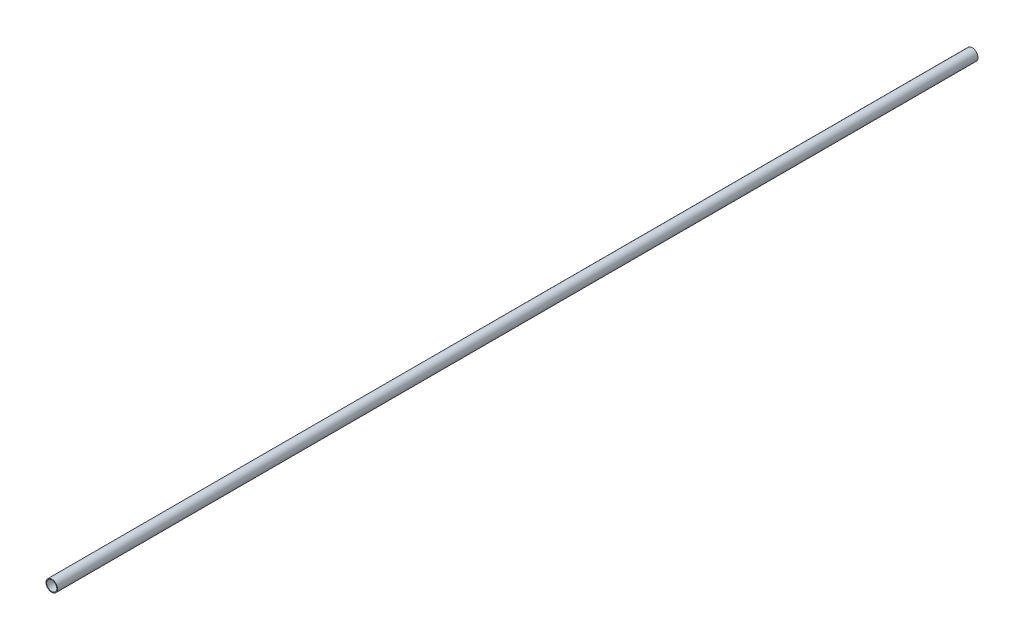
ISO-10303-21;
HEADER;
FILE_DESCRIPTION(('STEP AP214'),'2;1');
FILE_NAME('part.step','',(''),(''),'','','');
FILE_SCHEMA(('AUTOMOTIVE_DESIGN { 1 0 10303 214 1 1 1 1 }'));
ENDSEC;
DATA;
#1=APPLICATION_CONTEXT('core data for automotive mechanical design processes');
#2=APPLICATION_PROTOCOL_DEFINITION('international standard','automotive_design',2000,#1);
#3=PRODUCT_CONTEXT('',#1,'mechanical');
#4=PRODUCT('Part','Part','',(#3));
#5=PRODUCT_RELATED_PRODUCT_CATEGORY('part','',(#4));
#6=PRODUCT_DEFINITION_FORMATION('','',#4);
#7=PRODUCT_DEFINITION_CONTEXT('part definition',#1,'design');
#8=PRODUCT_DEFINITION('design','',#6,#7);
#9=PRODUCT_DEFINITION_SHAPE('','',#8);
#10=(LENGTH_UNIT() NAMED_UNIT(*) SI_UNIT(.MILLI.,.METRE.));
#11=(NAMED_UNIT(*) PLANE_ANGLE_UNIT() SI_UNIT($,.RADIAN.));
#12=(NAMED_UNIT(*) SI_UNIT($,.STERADIAN.) SOLID_ANGLE_UNIT());
#13=UNCERTAINTY_MEASURE_WITH_UNIT(LENGTH_MEASURE(1.E-05),#10,'distance_accuracy_value','');
#14=(GEOMETRIC_REPRESENTATION_CONTEXT(3) GLOBAL_UNCERTAINTY_ASSIGNED_CONTEXT((#13)) GLOBAL_UNIT_ASSIGNED_CONTEXT((#10,
#11,#12)) REPRESENTATION_CONTEXT('',''));
#15=CARTESIAN_POINT('',(0.,0.,0.));
#16=DIRECTION('',(0.,0.,1.));
#17=DIRECTION('',(1.,0.,0.));
#18=AXIS2_PLACEMENT_3D('',#15,#16,#17);
#19=CARTESIAN_POINT('',(0.,0.,2000.));
#20=DIRECTION('',(0.,0.,1.));
#21=DIRECTION('',(1.,0.,0.));
#22=AXIS2_PLACEMENT_3D('',#19,#20,#21);
#23=PLANE('',#22);
#24=CARTESIAN_POINT('',(0.,0.,2000.));
#25=DIRECTION('',(0.,0.,1.));
#26=DIRECTION('',(1.,0.,0.));
#27=AXIS2_PLACEMENT_3D('',#24,#25,#26);
#28=CIRCLE('',#27,12.5);
#29=CARTESIAN_POINT('',(12.5,0.,2000.));
#30=VERTEX_POINT('',#29);
#31=EDGE_CURVE('E10',#30,#30,#28,.T.);
#32=ORIENTED_EDGE('',*,*,#31,.T.);
#33=EDGE_LOOP('',(#32));
#34=FACE_BOUND('',#33,.T.);
#35=CARTESIAN_POINT('',(0.,0.,2000.));
#36=DIRECTION('',(0.,0.,1.));
#37=DIRECTION('',(1.,0.,0.));
#38=AXIS2_PLACEMENT_3D('',#35,#36,#37);
#39=CIRCLE('',#38,11.);
#40=CARTESIAN_POINT('',(11.,0.,2000.));
#41=VERTEX_POINT('',#40);
#42=EDGE_CURVE('E50',#41,#41,#39,.T.);
#43=ORIENTED_EDGE('',*,*,#42,.F.);
#44=EDGE_LOOP('',(#43));
#45=FACE_BOUND('',#44,.T.);
#46=ADVANCED_FACE('F39',(#34,#45),#23,.T.);
#47=CARTESIAN_POINT('',(0.,0.,0.));
#48=DIRECTION('',(0.,0.,1.));
#49=DIRECTION('',(1.,0.,0.));
#50=AXIS2_PLACEMENT_3D('',#47,#48,#49);
#51=PLANE('',#50);
#52=CARTESIAN_POINT('',(0.,0.,0.));
#53=DIRECTION('',(0.,0.,1.));
#54=DIRECTION('',(1.,0.,0.));
#55=AXIS2_PLACEMENT_3D('',#52,#53,#54);
#56=CIRCLE('',#55,12.5);
#57=CARTESIAN_POINT('',(12.5,0.,0.));
#58=VERTEX_POINT('',#57);
#59=EDGE_CURVE('E43',#58,#58,#56,.T.);
#60=ORIENTED_EDGE('',*,*,#59,.F.);
#61=EDGE_LOOP('',(#60));
#62=FACE_BOUND('',#61,.T.);
#63=CARTESIAN_POINT('',(0.,0.,0.));
#64=DIRECTION('',(0.,0.,1.));
#65=DIRECTION('',(1.,0.,0.));
#66=AXIS2_PLACEMENT_3D('',#63,#64,#65);
#67=CIRCLE('',#66,11.);
#68=CARTESIAN_POINT('',(11.,0.,0.));
#69=VERTEX_POINT('',#68);
#70=EDGE_CURVE('E52',#69,#69,#67,.T.);
#71=ORIENTED_EDGE('',*,*,#70,.T.);
#72=EDGE_LOOP('',(#71));
#73=FACE_BOUND('',#72,.T.);
#74=ADVANCED_FACE('F62',(#62,#73),#51,.F.);
#75=CARTESIAN_POINT('',(0.,0.,2000.));
#76=DIRECTION('',(0.,0.,-1.));
#77=DIRECTION('',(-1.,0.,0.));
#78=AXIS2_PLACEMENT_3D('',#75,#76,#77);
#79=CYLINDRICAL_SURFACE('',#78,12.5);
#80=ORIENTED_EDGE('',*,*,#31,.F.);
#81=EDGE_LOOP('',(#80));
#82=FACE_BOUND('',#81,.T.);
#83=ORIENTED_EDGE('',*,*,#59,.T.);
#84=EDGE_LOOP('',(#83));
#85=FACE_BOUND('',#84,.T.);
#86=ADVANCED_FACE('F41',(#82,#85),#79,.T.);
#87=CARTESIAN_POINT('',(0.,0.,2000.));
#88=DIRECTION('',(0.,0.,-1.));
#89=DIRECTION('',(-1.,0.,0.));
#90=AXIS2_PLACEMENT_3D('',#87,#88,#89);
#91=CYLINDRICAL_SURFACE('',#90,11.);
#92=ORIENTED_EDGE('',*,*,#42,.T.);
#93=EDGE_LOOP('',(#92));
#94=FACE_BOUND('',#93,.T.);
#95=ORIENTED_EDGE('',*,*,#70,.F.);
#96=EDGE_LOOP('',(#95));
#97=FACE_BOUND('',#96,.T.);
#98=ADVANCED_FACE('F58',(#94,#97),#91,.F.);
#99=CLOSED_SHELL('',(#46,#74,#86,#98));
#100=MANIFOLD_SOLID_BREP('B2',#99);
#101=ADVANCED_BREP_SHAPE_REPRESENTATION('',(#18,#100),#14);
#102=SHAPE_DEFINITION_REPRESENTATION(#9,#101);
ENDSEC;
END-ISO-10303-21;
